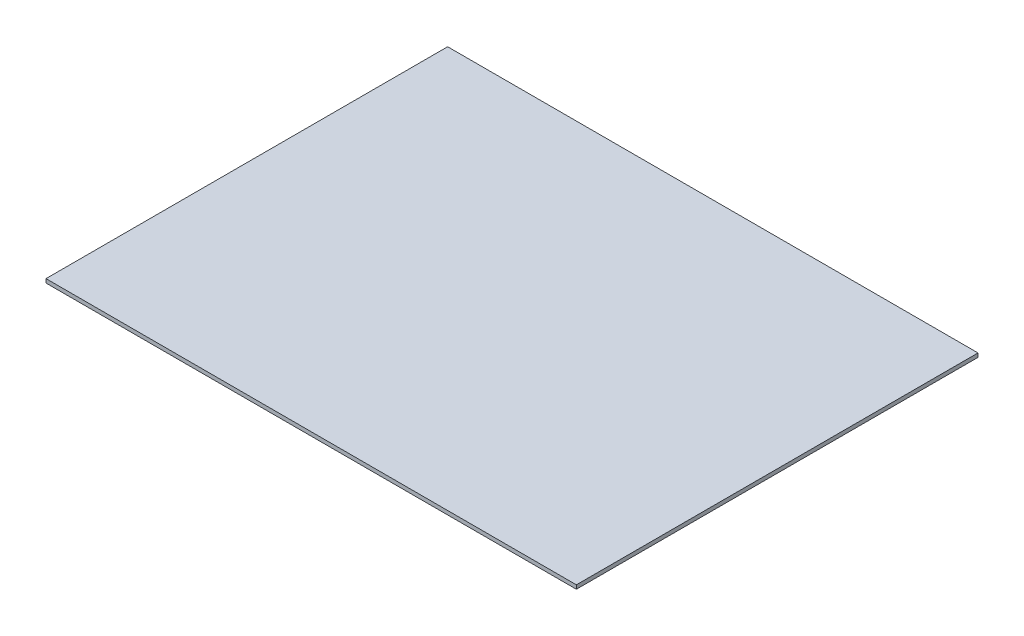
ISO-10303-21;
HEADER;
FILE_DESCRIPTION(('STEP AP214'),'2;1');
FILE_NAME('part.step','',(''),(''),'','','');
FILE_SCHEMA(('AUTOMOTIVE_DESIGN { 1 0 10303 214 1 1 1 1 }'));
ENDSEC;
DATA;
#1=APPLICATION_CONTEXT('core data for automotive mechanical design processes');
#2=APPLICATION_PROTOCOL_DEFINITION('international standard','automotive_design',2000,#1);
#3=PRODUCT_CONTEXT('',#1,'mechanical');
#4=PRODUCT('Part','Part','',(#3));
#5=PRODUCT_RELATED_PRODUCT_CATEGORY('part','',(#4));
#6=PRODUCT_DEFINITION_FORMATION('','',#4);
#7=PRODUCT_DEFINITION_CONTEXT('part definition',#1,'design');
#8=PRODUCT_DEFINITION('design','',#6,#7);
#9=PRODUCT_DEFINITION_SHAPE('','',#8);
#10=(LENGTH_UNIT() NAMED_UNIT(*) SI_UNIT(.MILLI.,.METRE.));
#11=(NAMED_UNIT(*) PLANE_ANGLE_UNIT() SI_UNIT($,.RADIAN.));
#12=(NAMED_UNIT(*) SI_UNIT($,.STERADIAN.) SOLID_ANGLE_UNIT());
#13=UNCERTAINTY_MEASURE_WITH_UNIT(LENGTH_MEASURE(1.E-05),#10,'distance_accuracy_value','');
#14=(GEOMETRIC_REPRESENTATION_CONTEXT(3) GLOBAL_UNCERTAINTY_ASSIGNED_CONTEXT((#13)) GLOBAL_UNIT_ASSIGNED_CONTEXT((#10,
#11,#12)) REPRESENTATION_CONTEXT('',''));
#15=CARTESIAN_POINT('',(0.,0.,0.));
#16=DIRECTION('',(0.,0.,1.));
#17=DIRECTION('',(1.,0.,0.));
#18=AXIS2_PLACEMENT_3D('',#15,#16,#17);
#19=CARTESIAN_POINT('',(-225.932279394302,3.,-350.47503306471));
#20=DIRECTION('',(0.,0.,1.));
#21=DIRECTION('',(1.,0.,0.));
#22=AXIS2_PLACEMENT_3D('',#19,#20,#21);
#23=PLANE('',#22);
#24=DIRECTION('',(-1.,0.,0.));
#25=VECTOR('',#24,1.);
#26=CARTESIAN_POINT('',(-225.932279394302,0.,-350.47503306471));
#27=LINE('',#26,#25);
#28=CARTESIAN_POINT('',(186.067720605698,0.,-350.47503306471));
#29=VERTEX_POINT('',#28);
#30=CARTESIAN_POINT('',(-225.932279394302,0.,-350.47503306471));
#31=VERTEX_POINT('',#30);
#32=EDGE_CURVE('E97',#29,#31,#27,.T.);
#33=ORIENTED_EDGE('',*,*,#32,.T.);
#34=DIRECTION('',(0.,-1.,0.));
#35=VECTOR('',#34,1.);
#36=CARTESIAN_POINT('',(-225.932279394302,3.,-350.47503306471));
#37=LINE('',#36,#35);
#38=CARTESIAN_POINT('',(-225.932279394302,3.,-350.47503306471));
#39=VERTEX_POINT('',#38);
#40=EDGE_CURVE('E11',#39,#31,#37,.T.);
#41=ORIENTED_EDGE('',*,*,#40,.F.);
#42=DIRECTION('',(-1.,0.,0.));
#43=VECTOR('',#42,1.);
#44=CARTESIAN_POINT('',(-225.932279394302,3.,-350.47503306471));
#45=LINE('',#44,#43);
#46=CARTESIAN_POINT('',(186.067720605698,3.,-350.47503306471));
#47=VERTEX_POINT('',#46);
#48=EDGE_CURVE('E85',#47,#39,#45,.T.);
#49=ORIENTED_EDGE('',*,*,#48,.F.);
#50=DIRECTION('',(0.,-1.,0.));
#51=VECTOR('',#50,1.);
#52=CARTESIAN_POINT('',(186.067720605698,3.,-350.47503306471));
#53=LINE('',#52,#51);
#54=EDGE_CURVE('E93',#47,#29,#53,.T.);
#55=ORIENTED_EDGE('',*,*,#54,.T.);
#56=EDGE_LOOP('',(#33,#41,#49,#55));
#57=FACE_BOUND('',#56,.T.);
#58=ADVANCED_FACE('F34',(#57),#23,.F.);
#59=CARTESIAN_POINT('',(-225.932279394302,3.,-350.47503306471));
#60=DIRECTION('',(1.,0.,0.));
#61=DIRECTION('',(0.,0.,-1.));
#62=AXIS2_PLACEMENT_3D('',#59,#60,#61);
#63=PLANE('',#62);
#64=DIRECTION('',(0.,0.,1.));
#65=VECTOR('',#64,1.);
#66=CARTESIAN_POINT('',(-225.932279394302,0.,-350.47503306471));
#67=LINE('',#66,#65);
#68=CARTESIAN_POINT('',(-225.932279394302,0.,-38.4750330647103));
#69=VERTEX_POINT('',#68);
#70=EDGE_CURVE('E89',#31,#69,#67,.T.);
#71=ORIENTED_EDGE('',*,*,#70,.T.);
#72=DIRECTION('',(0.,-1.,0.));
#73=VECTOR('',#72,1.);
#74=CARTESIAN_POINT('',(-225.932279394302,3.,-38.4750330647103));
#75=LINE('',#74,#73);
#76=CARTESIAN_POINT('',(-225.932279394302,3.,-38.4750330647103));
#77=VERTEX_POINT('',#76);
#78=EDGE_CURVE('E42',#77,#69,#75,.T.);
#79=ORIENTED_EDGE('',*,*,#78,.F.);
#80=DIRECTION('',(0.,0.,1.));
#81=VECTOR('',#80,1.);
#82=CARTESIAN_POINT('',(-225.932279394302,3.,-350.47503306471));
#83=LINE('',#82,#81);
#84=EDGE_CURVE('E80',#39,#77,#83,.T.);
#85=ORIENTED_EDGE('',*,*,#84,.F.);
#86=ORIENTED_EDGE('',*,*,#40,.T.);
#87=EDGE_LOOP('',(#71,#79,#85,#86));
#88=FACE_BOUND('',#87,.T.);
#89=ADVANCED_FACE('F88',(#88),#63,.F.);
#90=CARTESIAN_POINT('',(-225.932279394302,3.,-38.4750330647103));
#91=DIRECTION('',(0.,0.,-1.));
#92=DIRECTION('',(-1.,0.,0.));
#93=AXIS2_PLACEMENT_3D('',#90,#91,#92);
#94=PLANE('',#93);
#95=DIRECTION('',(1.,0.,0.));
#96=VECTOR('',#95,1.);
#97=CARTESIAN_POINT('',(-225.932279394302,0.,-38.4750330647103));
#98=LINE('',#97,#96);
#99=CARTESIAN_POINT('',(186.067720605699,0.,-38.47503306471));
#100=VERTEX_POINT('',#99);
#101=EDGE_CURVE('E67',#69,#100,#98,.T.);
#102=ORIENTED_EDGE('',*,*,#101,.T.);
#103=DIRECTION('',(0.,-1.,0.));
#104=VECTOR('',#103,1.);
#105=CARTESIAN_POINT('',(186.067720605699,3.,-38.47503306471));
#106=LINE('',#105,#104);
#107=CARTESIAN_POINT('',(186.067720605699,3.,-38.47503306471));
#108=VERTEX_POINT('',#107);
#109=EDGE_CURVE('E90',#108,#100,#106,.T.);
#110=ORIENTED_EDGE('',*,*,#109,.F.);
#111=DIRECTION('',(1.,0.,0.));
#112=VECTOR('',#111,1.);
#113=CARTESIAN_POINT('',(-225.932279394302,3.,-38.4750330647103));
#114=LINE('',#113,#112);
#115=EDGE_CURVE('E83',#77,#108,#114,.T.);
#116=ORIENTED_EDGE('',*,*,#115,.F.);
#117=ORIENTED_EDGE('',*,*,#78,.T.);
#118=EDGE_LOOP('',(#102,#110,#116,#117));
#119=FACE_BOUND('',#118,.T.);
#120=ADVANCED_FACE('F91',(#119),#94,.F.);
#121=CARTESIAN_POINT('',(186.067720605698,3.,-350.47503306471));
#122=DIRECTION('',(-1.,0.,0.));
#123=DIRECTION('',(0.,0.,1.));
#124=AXIS2_PLACEMENT_3D('',#121,#122,#123);
#125=PLANE('',#124);
#126=DIRECTION('',(0.,0.,-1.));
#127=VECTOR('',#126,1.);
#128=CARTESIAN_POINT('',(186.067720605698,0.,-350.47503306471));
#129=LINE('',#128,#127);
#130=EDGE_CURVE('E73',#100,#29,#129,.T.);
#131=ORIENTED_EDGE('',*,*,#130,.T.);
#132=ORIENTED_EDGE('',*,*,#54,.F.);
#133=DIRECTION('',(0.,0.,-1.));
#134=VECTOR('',#133,1.);
#135=CARTESIAN_POINT('',(186.067720605698,3.,-350.47503306471));
#136=LINE('',#135,#134);
#137=EDGE_CURVE('E50',#108,#47,#136,.T.);
#138=ORIENTED_EDGE('',*,*,#137,.F.);
#139=ORIENTED_EDGE('',*,*,#109,.T.);
#140=EDGE_LOOP('',(#131,#132,#138,#139));
#141=FACE_BOUND('',#140,.T.);
#142=ADVANCED_FACE('F104',(#141),#125,.F.);
#143=CARTESIAN_POINT('',(0.,3.,0.));
#144=DIRECTION('',(0.,-1.,0.));
#145=DIRECTION('',(0.,0.,-1.));
#146=AXIS2_PLACEMENT_3D('',#143,#144,#145);
#147=PLANE('',#146);
#148=ORIENTED_EDGE('',*,*,#48,.T.);
#149=ORIENTED_EDGE('',*,*,#84,.T.);
#150=ORIENTED_EDGE('',*,*,#115,.T.);
#151=ORIENTED_EDGE('',*,*,#137,.T.);
#152=EDGE_LOOP('',(#148,#149,#150,#151));
#153=FACE_BOUND('',#152,.T.);
#154=ADVANCED_FACE('F81',(#153),#147,.F.);
#155=CARTESIAN_POINT('',(0.,0.,0.));
#156=DIRECTION('',(0.,-1.,0.));
#157=DIRECTION('',(0.,0.,-1.));
#158=AXIS2_PLACEMENT_3D('',#155,#156,#157);
#159=PLANE('',#158);
#160=ORIENTED_EDGE('',*,*,#32,.F.);
#161=ORIENTED_EDGE('',*,*,#130,.F.);
#162=ORIENTED_EDGE('',*,*,#101,.F.);
#163=ORIENTED_EDGE('',*,*,#70,.F.);
#164=EDGE_LOOP('',(#160,#161,#162,#163));
#165=FACE_BOUND('',#164,.T.);
#166=ADVANCED_FACE('F107',(#165),#159,.T.);
#167=CLOSED_SHELL('',(#58,#89,#120,#142,#154,#166));
#168=MANIFOLD_SOLID_BREP('B2',#167);
#169=ADVANCED_BREP_SHAPE_REPRESENTATION('',(#18,#168),#14);
#170=SHAPE_DEFINITION_REPRESENTATION(#9,#169);
ENDSEC;
END-ISO-10303-21;
